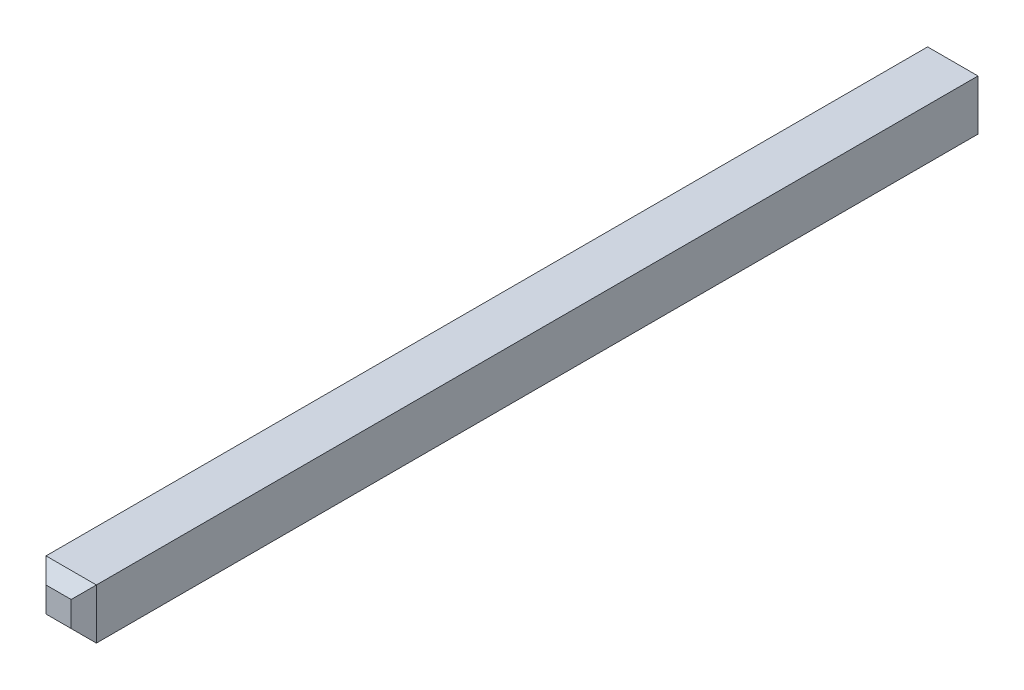
ISO-10303-21;
HEADER;
FILE_DESCRIPTION(('STEP AP214'),'2;1');
FILE_NAME('part.step','',(''),(''),'','','');
FILE_SCHEMA(('AUTOMOTIVE_DESIGN { 1 0 10303 214 1 1 1 1 }'));
ENDSEC;
DATA;
#1=APPLICATION_CONTEXT('core data for automotive mechanical design processes');
#2=APPLICATION_PROTOCOL_DEFINITION('international standard','automotive_design',2000,#1);
#3=PRODUCT_CONTEXT('',#1,'mechanical');
#4=PRODUCT('Part','Part','',(#3));
#5=PRODUCT_RELATED_PRODUCT_CATEGORY('part','',(#4));
#6=PRODUCT_DEFINITION_FORMATION('','',#4);
#7=PRODUCT_DEFINITION_CONTEXT('part definition',#1,'design');
#8=PRODUCT_DEFINITION('design','',#6,#7);
#9=PRODUCT_DEFINITION_SHAPE('','',#8);
#10=(LENGTH_UNIT() NAMED_UNIT(*) SI_UNIT(.MILLI.,.METRE.));
#11=(NAMED_UNIT(*) PLANE_ANGLE_UNIT() SI_UNIT($,.RADIAN.));
#12=(NAMED_UNIT(*) SI_UNIT($,.STERADIAN.) SOLID_ANGLE_UNIT());
#13=UNCERTAINTY_MEASURE_WITH_UNIT(LENGTH_MEASURE(1.E-05),#10,'distance_accuracy_value','');
#14=(GEOMETRIC_REPRESENTATION_CONTEXT(3) GLOBAL_UNCERTAINTY_ASSIGNED_CONTEXT((#13)) GLOBAL_UNIT_ASSIGNED_CONTEXT((#10,
#11,#12)) REPRESENTATION_CONTEXT('',''));
#15=CARTESIAN_POINT('',(0.,0.,0.));
#16=DIRECTION('',(0.,0.,1.));
#17=DIRECTION('',(1.,0.,0.));
#18=AXIS2_PLACEMENT_3D('',#15,#16,#17);
#19=CARTESIAN_POINT('',(-0.15875,-0.238125,-2.460625));
#20=DIRECTION('',(0.,-0.707106781186548,-0.707106781186548));
#21=DIRECTION('',(0.,0.707106781186548,-0.707106781186548));
#22=AXIS2_PLACEMENT_3D('',#19,#20,#21);
#23=PLANE('',#22);
#24=DIRECTION('',(1.,0.,0.));
#25=VECTOR('',#24,1.);
#26=CARTESIAN_POINT('',(-0.3175,-0.3175,-2.38125));
#27=LINE('',#26,#25);
#28=CARTESIAN_POINT('',(-0.3175,-0.3175,-2.38125));
#29=VERTEX_POINT('',#28);
#30=CARTESIAN_POINT('',(0.3175,-0.3175,-2.38125));
#31=VERTEX_POINT('',#30);
#32=EDGE_CURVE('E95',#29,#31,#27,.T.);
#33=ORIENTED_EDGE('',*,*,#32,.F.);
#34=DIRECTION('',(-0.577350269189626,-0.577350269189627,0.577350269189625));
#35=VECTOR('',#34,1.);
#36=CARTESIAN_POINT('',(-0.15875,-0.15875,-2.54));
#37=LINE('',#36,#35);
#38=CARTESIAN_POINT('',(-0.15875,-0.15875,-2.54));
#39=VERTEX_POINT('',#38);
#40=EDGE_CURVE('E93',#39,#29,#37,.T.);
#41=ORIENTED_EDGE('',*,*,#40,.F.);
#42=DIRECTION('',(-1.,0.,0.));
#43=VECTOR('',#42,1.);
#44=CARTESIAN_POINT('',(0.,-0.15875,-2.54));
#45=LINE('',#44,#43);
#46=CARTESIAN_POINT('',(0.15875,-0.15875,-2.54));
#47=VERTEX_POINT('',#46);
#48=EDGE_CURVE('E19',#47,#39,#45,.T.);
#49=ORIENTED_EDGE('',*,*,#48,.F.);
#50=DIRECTION('',(-0.577350269189626,0.577350269189627,-0.577350269189625));
#51=VECTOR('',#50,1.);
#52=CARTESIAN_POINT('',(0.3175,-0.3175,-2.38125));
#53=LINE('',#52,#51);
#54=EDGE_CURVE('E112',#31,#47,#53,.T.);
#55=ORIENTED_EDGE('',*,*,#54,.F.);
#56=EDGE_LOOP('',(#33,#41,#49,#55));
#57=FACE_BOUND('',#56,.T.);
#58=ADVANCED_FACE('F16',(#57),#23,.T.);
#59=CARTESIAN_POINT('',(-0.15875,-0.238125,8.810625));
#60=DIRECTION('',(0.,-0.707106781186547,0.707106781186548));
#61=DIRECTION('',(0.,-0.707106781186548,-0.707106781186547));
#62=AXIS2_PLACEMENT_3D('',#59,#60,#61);
#63=PLANE('',#62);
#64=DIRECTION('',(1.,0.,0.));
#65=VECTOR('',#64,1.);
#66=CARTESIAN_POINT('',(-0.3175,-0.3175,8.73125));
#67=LINE('',#66,#65);
#68=CARTESIAN_POINT('',(0.3175,-0.317500000000001,8.73125));
#69=VERTEX_POINT('',#68);
#70=CARTESIAN_POINT('',(-0.3175,-0.317500000000001,8.73125));
#71=VERTEX_POINT('',#70);
#72=EDGE_CURVE('E120',#69,#71,#67,.F.);
#73=ORIENTED_EDGE('',*,*,#72,.F.);
#74=DIRECTION('',(0.577350269189627,-0.577350269189624,-0.577350269189627));
#75=VECTOR('',#74,1.);
#76=CARTESIAN_POINT('',(0.15875,-0.15875,8.89));
#77=LINE('',#76,#75);
#78=CARTESIAN_POINT('',(0.15875,-0.15875,8.89));
#79=VERTEX_POINT('',#78);
#80=EDGE_CURVE('E117',#79,#69,#77,.T.);
#81=ORIENTED_EDGE('',*,*,#80,.F.);
#82=DIRECTION('',(1.,0.,0.));
#83=VECTOR('',#82,1.);
#84=CARTESIAN_POINT('',(0.,-0.15875,8.89));
#85=LINE('',#84,#83);
#86=CARTESIAN_POINT('',(-0.15875,-0.15875,8.89));
#87=VERTEX_POINT('',#86);
#88=EDGE_CURVE('E78',#87,#79,#85,.T.);
#89=ORIENTED_EDGE('',*,*,#88,.F.);
#90=DIRECTION('',(0.577350269189627,0.577350269189624,0.577350269189627));
#91=VECTOR('',#90,1.);
#92=CARTESIAN_POINT('',(-0.317500000000001,-0.3175,8.73125));
#93=LINE('',#92,#91);
#94=EDGE_CURVE('E105',#71,#87,#93,.T.);
#95=ORIENTED_EDGE('',*,*,#94,.F.);
#96=EDGE_LOOP('',(#73,#81,#89,#95));
#97=FACE_BOUND('',#96,.T.);
#98=ADVANCED_FACE('F282',(#97),#63,.T.);
#99=CARTESIAN_POINT('',(0.,0.,-2.54));
#100=DIRECTION('',(0.,0.,-1.));
#101=DIRECTION('',(-1.,0.,0.));
#102=AXIS2_PLACEMENT_3D('',#99,#100,#101);
#103=PLANE('',#102);
#104=DIRECTION('',(0.,1.,0.));
#105=VECTOR('',#104,1.);
#106=CARTESIAN_POINT('',(0.15875,-0.15875,-2.54));
#107=LINE('',#106,#105);
#108=CARTESIAN_POINT('',(0.15875,0.15875,-2.54));
#109=VERTEX_POINT('',#108);
#110=EDGE_CURVE('E89',#47,#109,#107,.T.);
#111=ORIENTED_EDGE('',*,*,#110,.F.);
#112=ORIENTED_EDGE('',*,*,#48,.T.);
#113=DIRECTION('',(0.,1.,0.));
#114=VECTOR('',#113,1.);
#115=CARTESIAN_POINT('',(-0.15875,0.15875,-2.54));
#116=LINE('',#115,#114);
#117=CARTESIAN_POINT('',(-0.15875,0.15875,-2.54));
#118=VERTEX_POINT('',#117);
#119=EDGE_CURVE('E87',#118,#39,#116,.F.);
#120=ORIENTED_EDGE('',*,*,#119,.F.);
#121=DIRECTION('',(1.,0.,0.));
#122=VECTOR('',#121,1.);
#123=CARTESIAN_POINT('',(0.15875,0.15875,-2.54));
#124=LINE('',#123,#122);
#125=EDGE_CURVE('E126',#109,#118,#124,.F.);
#126=ORIENTED_EDGE('',*,*,#125,.F.);
#127=EDGE_LOOP('',(#111,#112,#120,#126));
#128=FACE_BOUND('',#127,.T.);
#129=ADVANCED_FACE('F84',(#128),#103,.T.);
#130=CARTESIAN_POINT('',(-0.238125,0.15875,-2.460625));
#131=DIRECTION('',(-0.707106781186548,0.,-0.707106781186548));
#132=DIRECTION('',(-0.707106781186548,0.,0.707106781186548));
#133=AXIS2_PLACEMENT_3D('',#130,#131,#132);
#134=PLANE('',#133);
#135=DIRECTION('',(0.,1.,0.));
#136=VECTOR('',#135,1.);
#137=CARTESIAN_POINT('',(-0.3175,0.3175,-2.38125));
#138=LINE('',#137,#136);
#139=CARTESIAN_POINT('',(-0.3175,0.3175,-2.38125));
#140=VERTEX_POINT('',#139);
#141=EDGE_CURVE('E129',#140,#29,#138,.F.);
#142=ORIENTED_EDGE('',*,*,#141,.F.);
#143=DIRECTION('',(-0.577350269189627,0.577350269189626,0.577350269189625));
#144=VECTOR('',#143,1.);
#145=CARTESIAN_POINT('',(-0.15875,0.15875,-2.54));
#146=LINE('',#145,#144);
#147=EDGE_CURVE('E101',#118,#140,#146,.T.);
#148=ORIENTED_EDGE('',*,*,#147,.F.);
#149=ORIENTED_EDGE('',*,*,#119,.T.);
#150=ORIENTED_EDGE('',*,*,#40,.T.);
#151=EDGE_LOOP('',(#142,#148,#149,#150));
#152=FACE_BOUND('',#151,.T.);
#153=ADVANCED_FACE('F99',(#152),#134,.T.);
#154=CARTESIAN_POINT('',(0.,0.,8.89));
#155=DIRECTION('',(0.,0.,1.));
#156=DIRECTION('',(1.,0.,0.));
#157=AXIS2_PLACEMENT_3D('',#154,#155,#156);
#158=PLANE('',#157);
#159=ORIENTED_EDGE('',*,*,#88,.T.);
#160=DIRECTION('',(0.,1.,0.));
#161=VECTOR('',#160,1.);
#162=CARTESIAN_POINT('',(0.15875,-0.15875,8.89));
#163=LINE('',#162,#161);
#164=CARTESIAN_POINT('',(0.15875,0.15875,8.89));
#165=VERTEX_POINT('',#164);
#166=EDGE_CURVE('E114',#165,#79,#163,.F.);
#167=ORIENTED_EDGE('',*,*,#166,.F.);
#168=DIRECTION('',(1.,0.,0.));
#169=VECTOR('',#168,1.);
#170=CARTESIAN_POINT('',(0.15875,0.15875,8.89));
#171=LINE('',#170,#169);
#172=CARTESIAN_POINT('',(-0.15875,0.15875,8.89));
#173=VERTEX_POINT('',#172);
#174=EDGE_CURVE('E138',#173,#165,#171,.T.);
#175=ORIENTED_EDGE('',*,*,#174,.F.);
#176=DIRECTION('',(0.,1.,0.));
#177=VECTOR('',#176,1.);
#178=CARTESIAN_POINT('',(-0.15875,0.15875,8.89));
#179=LINE('',#178,#177);
#180=EDGE_CURVE('E108',#87,#173,#179,.T.);
#181=ORIENTED_EDGE('',*,*,#180,.F.);
#182=EDGE_LOOP('',(#159,#167,#175,#181));
#183=FACE_BOUND('',#182,.T.);
#184=ADVANCED_FACE('F258',(#183),#158,.T.);
#185=CARTESIAN_POINT('',(-0.238125,0.15875,8.810625));
#186=DIRECTION('',(-0.707106781186547,0.,0.707106781186548));
#187=DIRECTION('',(0.707106781186548,0.,0.707106781186547));
#188=AXIS2_PLACEMENT_3D('',#185,#186,#187);
#189=PLANE('',#188);
#190=ORIENTED_EDGE('',*,*,#180,.T.);
#191=DIRECTION('',(0.577350269189624,-0.577350269189627,0.577350269189627));
#192=VECTOR('',#191,1.);
#193=CARTESIAN_POINT('',(-0.3175,0.317500000000001,8.73125));
#194=LINE('',#193,#192);
#195=CARTESIAN_POINT('',(-0.317500000000001,0.3175,8.73125));
#196=VERTEX_POINT('',#195);
#197=EDGE_CURVE('E143',#196,#173,#194,.T.);
#198=ORIENTED_EDGE('',*,*,#197,.F.);
#199=DIRECTION('',(0.,1.,0.));
#200=VECTOR('',#199,1.);
#201=CARTESIAN_POINT('',(-0.3175,0.3175,8.73125));
#202=LINE('',#201,#200);
#203=EDGE_CURVE('E135',#71,#196,#202,.T.);
#204=ORIENTED_EDGE('',*,*,#203,.F.);
#205=ORIENTED_EDGE('',*,*,#94,.T.);
#206=EDGE_LOOP('',(#190,#198,#204,#205));
#207=FACE_BOUND('',#206,.T.);
#208=ADVANCED_FACE('F250',(#207),#189,.T.);
#209=CARTESIAN_POINT('',(0.238125,-0.15875,-2.460625));
#210=DIRECTION('',(0.707106781186548,0.,-0.707106781186548));
#211=DIRECTION('',(-0.707106781186548,0.,-0.707106781186548));
#212=AXIS2_PLACEMENT_3D('',#209,#210,#211);
#213=PLANE('',#212);
#214=DIRECTION('',(0.,1.,0.));
#215=VECTOR('',#214,1.);
#216=CARTESIAN_POINT('',(0.3175,-0.3175,-2.38125));
#217=LINE('',#216,#215);
#218=CARTESIAN_POINT('',(0.3175,0.3175,-2.38125));
#219=VERTEX_POINT('',#218);
#220=EDGE_CURVE('E146',#31,#219,#217,.T.);
#221=ORIENTED_EDGE('',*,*,#220,.F.);
#222=ORIENTED_EDGE('',*,*,#54,.T.);
#223=ORIENTED_EDGE('',*,*,#110,.T.);
#224=DIRECTION('',(-0.577350269189627,-0.577350269189626,-0.577350269189625));
#225=VECTOR('',#224,1.);
#226=CARTESIAN_POINT('',(0.3175,0.3175,-2.38125));
#227=LINE('',#226,#225);
#228=EDGE_CURVE('E123',#219,#109,#227,.T.);
#229=ORIENTED_EDGE('',*,*,#228,.F.);
#230=EDGE_LOOP('',(#221,#222,#223,#229));
#231=FACE_BOUND('',#230,.T.);
#232=ADVANCED_FACE('F172',(#231),#213,.T.);
#233=CARTESIAN_POINT('',(0.238125,-0.15875,8.810625));
#234=DIRECTION('',(0.707106781186547,0.,0.707106781186548));
#235=DIRECTION('',(0.707106781186548,0.,-0.707106781186547));
#236=AXIS2_PLACEMENT_3D('',#233,#234,#235);
#237=PLANE('',#236);
#238=DIRECTION('',(0.,1.,0.));
#239=VECTOR('',#238,1.);
#240=CARTESIAN_POINT('',(0.3175,-0.3175,8.73125));
#241=LINE('',#240,#239);
#242=CARTESIAN_POINT('',(0.317500000000001,0.3175,8.73125));
#243=VERTEX_POINT('',#242);
#244=EDGE_CURVE('E34',#243,#69,#241,.F.);
#245=ORIENTED_EDGE('',*,*,#244,.F.);
#246=DIRECTION('',(0.577350269189624,0.577350269189627,-0.577350269189627));
#247=VECTOR('',#246,1.);
#248=CARTESIAN_POINT('',(0.15875,0.15875,8.89));
#249=LINE('',#248,#247);
#250=EDGE_CURVE('E141',#165,#243,#249,.T.);
#251=ORIENTED_EDGE('',*,*,#250,.F.);
#252=ORIENTED_EDGE('',*,*,#166,.T.);
#253=ORIENTED_EDGE('',*,*,#80,.T.);
#254=EDGE_LOOP('',(#245,#251,#252,#253));
#255=FACE_BOUND('',#254,.T.);
#256=ADVANCED_FACE('F189',(#255),#237,.T.);
#257=CARTESIAN_POINT('',(-0.3175,-0.3175,0.));
#258=DIRECTION('',(0.,-1.,0.));
#259=DIRECTION('',(0.,0.,-1.));
#260=AXIS2_PLACEMENT_3D('',#257,#258,#259);
#261=PLANE('',#260);
#262=ORIENTED_EDGE('',*,*,#72,.T.);
#263=DIRECTION('',(0.,0.,1.));
#264=VECTOR('',#263,1.);
#265=CARTESIAN_POINT('',(-0.3175,-0.3175,0.));
#266=LINE('',#265,#264);
#267=EDGE_CURVE('E132',#29,#71,#266,.T.);
#268=ORIENTED_EDGE('',*,*,#267,.F.);
#269=ORIENTED_EDGE('',*,*,#32,.T.);
#270=DIRECTION('',(0.,0.,-1.));
#271=VECTOR('',#270,1.);
#272=CARTESIAN_POINT('',(0.3175,-0.3175,0.));
#273=LINE('',#272,#271);
#274=EDGE_CURVE('E150',#69,#31,#273,.T.);
#275=ORIENTED_EDGE('',*,*,#274,.F.);
#276=EDGE_LOOP('',(#262,#268,#269,#275));
#277=FACE_BOUND('',#276,.T.);
#278=ADVANCED_FACE('F175',(#277),#261,.T.);
#279=CARTESIAN_POINT('',(0.15875,0.238125,-2.460625));
#280=DIRECTION('',(0.,0.707106781186548,-0.707106781186548));
#281=DIRECTION('',(0.,0.707106781186548,0.707106781186548));
#282=AXIS2_PLACEMENT_3D('',#279,#280,#281);
#283=PLANE('',#282);
#284=ORIENTED_EDGE('',*,*,#125,.T.);
#285=ORIENTED_EDGE('',*,*,#147,.T.);
#286=DIRECTION('',(1.,0.,0.));
#287=VECTOR('',#286,1.);
#288=CARTESIAN_POINT('',(0.3175,0.3175,-2.38125));
#289=LINE('',#288,#287);
#290=EDGE_CURVE('E153',#219,#140,#289,.F.);
#291=ORIENTED_EDGE('',*,*,#290,.F.);
#292=ORIENTED_EDGE('',*,*,#228,.T.);
#293=EDGE_LOOP('',(#284,#285,#291,#292));
#294=FACE_BOUND('',#293,.T.);
#295=ADVANCED_FACE('F180',(#294),#283,.T.);
#296=CARTESIAN_POINT('',(-0.3175,0.3175,0.));
#297=DIRECTION('',(-1.,0.,0.));
#298=DIRECTION('',(0.,0.,1.));
#299=AXIS2_PLACEMENT_3D('',#296,#297,#298);
#300=PLANE('',#299);
#301=ORIENTED_EDGE('',*,*,#203,.T.);
#302=DIRECTION('',(0.,0.,1.));
#303=VECTOR('',#302,1.);
#304=CARTESIAN_POINT('',(-0.3175,0.3175,0.));
#305=LINE('',#304,#303);
#306=EDGE_CURVE('E156',#140,#196,#305,.T.);
#307=ORIENTED_EDGE('',*,*,#306,.F.);
#308=ORIENTED_EDGE('',*,*,#141,.T.);
#309=ORIENTED_EDGE('',*,*,#267,.T.);
#310=EDGE_LOOP('',(#301,#307,#308,#309));
#311=FACE_BOUND('',#310,.T.);
#312=ADVANCED_FACE('F178',(#311),#300,.T.);
#313=CARTESIAN_POINT('',(0.15875,0.238125,8.810625));
#314=DIRECTION('',(0.,0.707106781186547,0.707106781186548));
#315=DIRECTION('',(0.,-0.707106781186548,0.707106781186547));
#316=AXIS2_PLACEMENT_3D('',#313,#314,#315);
#317=PLANE('',#316);
#318=DIRECTION('',(1.,0.,0.));
#319=VECTOR('',#318,1.);
#320=CARTESIAN_POINT('',(0.3175,0.3175,8.73125));
#321=LINE('',#320,#319);
#322=EDGE_CURVE('E25',#196,#243,#321,.T.);
#323=ORIENTED_EDGE('',*,*,#322,.F.);
#324=ORIENTED_EDGE('',*,*,#197,.T.);
#325=ORIENTED_EDGE('',*,*,#174,.T.);
#326=ORIENTED_EDGE('',*,*,#250,.T.);
#327=EDGE_LOOP('',(#323,#324,#325,#326));
#328=FACE_BOUND('',#327,.T.);
#329=ADVANCED_FACE('F166',(#328),#317,.T.);
#330=CARTESIAN_POINT('',(0.3175,-0.3175,0.));
#331=DIRECTION('',(1.,0.,0.));
#332=DIRECTION('',(0.,0.,-1.));
#333=AXIS2_PLACEMENT_3D('',#330,#331,#332);
#334=PLANE('',#333);
#335=ORIENTED_EDGE('',*,*,#244,.T.);
#336=ORIENTED_EDGE('',*,*,#274,.T.);
#337=ORIENTED_EDGE('',*,*,#220,.T.);
#338=DIRECTION('',(0.,0.,1.));
#339=VECTOR('',#338,1.);
#340=CARTESIAN_POINT('',(0.3175,0.3175,0.));
#341=LINE('',#340,#339);
#342=EDGE_CURVE('E11',#243,#219,#341,.F.);
#343=ORIENTED_EDGE('',*,*,#342,.F.);
#344=EDGE_LOOP('',(#335,#336,#337,#343));
#345=FACE_BOUND('',#344,.T.);
#346=ADVANCED_FACE('F168',(#345),#334,.T.);
#347=CARTESIAN_POINT('',(0.3175,0.3175,0.));
#348=DIRECTION('',(0.,1.,0.));
#349=DIRECTION('',(0.,0.,1.));
#350=AXIS2_PLACEMENT_3D('',#347,#348,#349);
#351=PLANE('',#350);
#352=ORIENTED_EDGE('',*,*,#322,.T.);
#353=ORIENTED_EDGE('',*,*,#342,.T.);
#354=ORIENTED_EDGE('',*,*,#290,.T.);
#355=ORIENTED_EDGE('',*,*,#306,.T.);
#356=EDGE_LOOP('',(#352,#353,#354,#355));
#357=FACE_BOUND('',#356,.T.);
#358=ADVANCED_FACE('F162',(#357),#351,.T.);
#359=CLOSED_SHELL('',(#58,#98,#129,#153,#184,#208,#232,#256,#278,#295,#312,#329,#346,#358));
#360=MANIFOLD_SOLID_BREP('B1',#359);
#361=ADVANCED_BREP_SHAPE_REPRESENTATION('',(#18,#360),#14);
#362=SHAPE_DEFINITION_REPRESENTATION(#9,#361);
ENDSEC;
END-ISO-10303-21;
